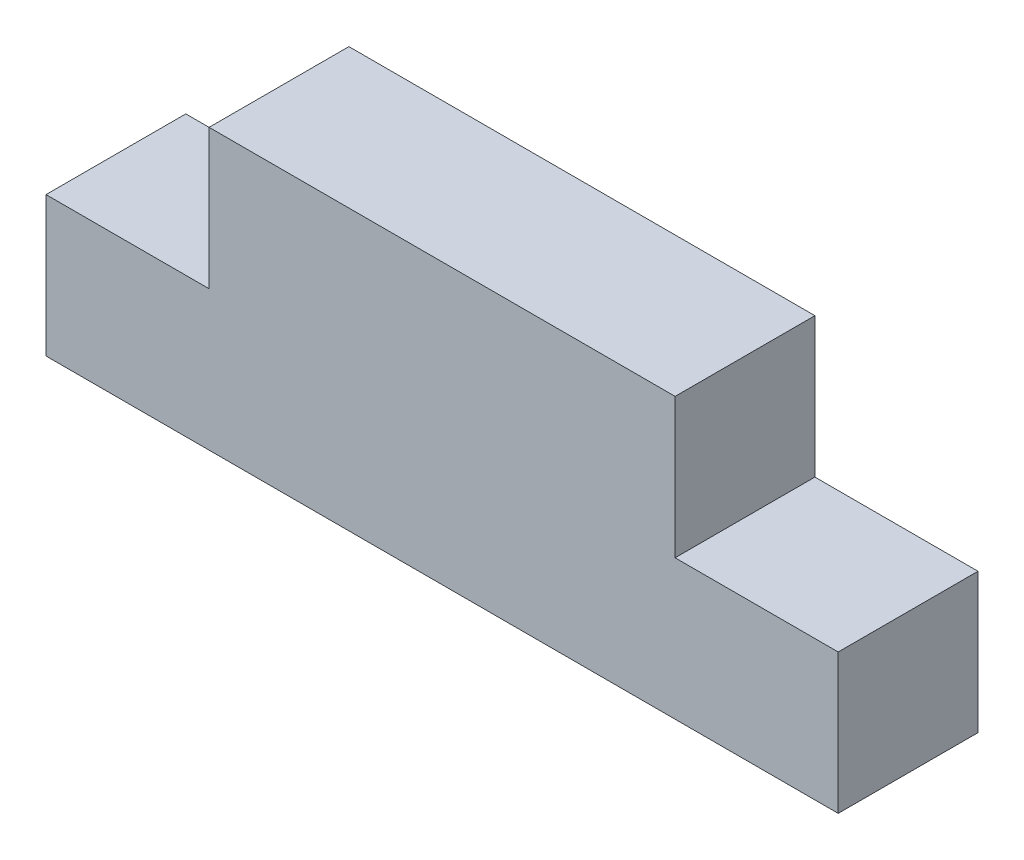
ISO-10303-21;
HEADER;
FILE_DESCRIPTION(('STEP AP214'),'2;1');
FILE_NAME('part.step','',(''),(''),'','','');
FILE_SCHEMA(('AUTOMOTIVE_DESIGN { 1 0 10303 214 1 1 1 1 }'));
ENDSEC;
DATA;
#1=APPLICATION_CONTEXT('core data for automotive mechanical design processes');
#2=APPLICATION_PROTOCOL_DEFINITION('international standard','automotive_design',2000,#1);
#3=PRODUCT_CONTEXT('',#1,'mechanical');
#4=PRODUCT('Part','Part','',(#3));
#5=PRODUCT_RELATED_PRODUCT_CATEGORY('part','',(#4));
#6=PRODUCT_DEFINITION_FORMATION('','',#4);
#7=PRODUCT_DEFINITION_CONTEXT('part definition',#1,'design');
#8=PRODUCT_DEFINITION('design','',#6,#7);
#9=PRODUCT_DEFINITION_SHAPE('','',#8);
#10=(LENGTH_UNIT() NAMED_UNIT(*) SI_UNIT(.MILLI.,.METRE.));
#11=(NAMED_UNIT(*) PLANE_ANGLE_UNIT() SI_UNIT($,.RADIAN.));
#12=(NAMED_UNIT(*) SI_UNIT($,.STERADIAN.) SOLID_ANGLE_UNIT());
#13=UNCERTAINTY_MEASURE_WITH_UNIT(LENGTH_MEASURE(1.E-05),#10,'distance_accuracy_value','');
#14=(GEOMETRIC_REPRESENTATION_CONTEXT(3) GLOBAL_UNCERTAINTY_ASSIGNED_CONTEXT((#13)) GLOBAL_UNIT_ASSIGNED_CONTEXT((#10,
#11,#12)) REPRESENTATION_CONTEXT('',''));
#15=CARTESIAN_POINT('',(0.,0.,0.));
#16=DIRECTION('',(0.,0.,1.));
#17=DIRECTION('',(1.,0.,0.));
#18=AXIS2_PLACEMENT_3D('',#15,#16,#17);
#19=CARTESIAN_POINT('',(0.,6.,6.));
#20=DIRECTION('',(0.,-1.,0.));
#21=DIRECTION('',(1.,0.,0.));
#22=AXIS2_PLACEMENT_3D('',#19,#20,#21);
#23=PLANE('',#22);
#24=DIRECTION('',(-1.,0.,0.));
#25=VECTOR('',#24,1.);
#26=CARTESIAN_POINT('',(0.,6.,0.));
#27=LINE('',#26,#25);
#28=CARTESIAN_POINT('',(34.,6.,0.));
#29=VERTEX_POINT('',#28);
#30=CARTESIAN_POINT('',(27.,6.,0.));
#31=VERTEX_POINT('',#30);
#32=EDGE_CURVE('E145',#29,#31,#27,.T.);
#33=ORIENTED_EDGE('',*,*,#32,.T.);
#34=DIRECTION('',(0.,0.,-1.));
#35=VECTOR('',#34,1.);
#36=CARTESIAN_POINT('',(27.,6.,6.));
#37=LINE('',#36,#35);
#38=CARTESIAN_POINT('',(27.,6.,6.));
#39=VERTEX_POINT('',#38);
#40=EDGE_CURVE('E11',#39,#31,#37,.T.);
#41=ORIENTED_EDGE('',*,*,#40,.F.);
#42=DIRECTION('',(-1.,0.,0.));
#43=VECTOR('',#42,1.);
#44=CARTESIAN_POINT('',(0.,6.,6.));
#45=LINE('',#44,#43);
#46=CARTESIAN_POINT('',(34.,6.,6.));
#47=VERTEX_POINT('',#46);
#48=EDGE_CURVE('E171',#47,#39,#45,.T.);
#49=ORIENTED_EDGE('',*,*,#48,.F.);
#50=DIRECTION('',(0.,0.,-1.));
#51=VECTOR('',#50,1.);
#52=CARTESIAN_POINT('',(34.,6.,6.));
#53=LINE('',#52,#51);
#54=EDGE_CURVE('E144',#47,#29,#53,.T.);
#55=ORIENTED_EDGE('',*,*,#54,.T.);
#56=EDGE_LOOP('',(#33,#41,#49,#55));
#57=FACE_BOUND('',#56,.T.);
#58=ADVANCED_FACE('F41',(#57),#23,.F.);
#59=CARTESIAN_POINT('',(27.,0.,6.));
#60=DIRECTION('',(-1.,0.,0.));
#61=DIRECTION('',(0.,0.,1.));
#62=AXIS2_PLACEMENT_3D('',#59,#60,#61);
#63=PLANE('',#62);
#64=DIRECTION('',(0.,1.,0.));
#65=VECTOR('',#64,1.);
#66=CARTESIAN_POINT('',(27.,0.,0.));
#67=LINE('',#66,#65);
#68=CARTESIAN_POINT('',(27.,12.,0.));
#69=VERTEX_POINT('',#68);
#70=EDGE_CURVE('E149',#31,#69,#67,.T.);
#71=ORIENTED_EDGE('',*,*,#70,.T.);
#72=DIRECTION('',(0.,0.,-1.));
#73=VECTOR('',#72,1.);
#74=CARTESIAN_POINT('',(27.,12.,6.));
#75=LINE('',#74,#73);
#76=CARTESIAN_POINT('',(27.,12.,6.));
#77=VERTEX_POINT('',#76);
#78=EDGE_CURVE('E50',#77,#69,#75,.T.);
#79=ORIENTED_EDGE('',*,*,#78,.F.);
#80=DIRECTION('',(0.,1.,0.));
#81=VECTOR('',#80,1.);
#82=CARTESIAN_POINT('',(27.,0.,6.));
#83=LINE('',#82,#81);
#84=EDGE_CURVE('E100',#39,#77,#83,.T.);
#85=ORIENTED_EDGE('',*,*,#84,.F.);
#86=ORIENTED_EDGE('',*,*,#40,.T.);
#87=EDGE_LOOP('',(#71,#79,#85,#86));
#88=FACE_BOUND('',#87,.T.);
#89=ADVANCED_FACE('F190',(#88),#63,.F.);
#90=CARTESIAN_POINT('',(0.,12.,6.));
#91=DIRECTION('',(0.,1.,0.));
#92=DIRECTION('',(0.,0.,1.));
#93=AXIS2_PLACEMENT_3D('',#90,#91,#92);
#94=PLANE('',#93);
#95=DIRECTION('',(1.,0.,0.));
#96=VECTOR('',#95,1.);
#97=CARTESIAN_POINT('',(0.,12.,0.));
#98=LINE('',#97,#96);
#99=CARTESIAN_POINT('',(7.,12.,0.));
#100=VERTEX_POINT('',#99);
#101=EDGE_CURVE('E153',#100,#69,#98,.T.);
#102=ORIENTED_EDGE('',*,*,#101,.F.);
#103=DIRECTION('',(0.,0.,-1.));
#104=VECTOR('',#103,1.);
#105=CARTESIAN_POINT('',(7.,12.,6.));
#106=LINE('',#105,#104);
#107=CARTESIAN_POINT('',(7.,12.,6.));
#108=VERTEX_POINT('',#107);
#109=EDGE_CURVE('E181',#108,#100,#106,.T.);
#110=ORIENTED_EDGE('',*,*,#109,.F.);
#111=DIRECTION('',(1.,0.,0.));
#112=VECTOR('',#111,1.);
#113=CARTESIAN_POINT('',(0.,12.,6.));
#114=LINE('',#113,#112);
#115=EDGE_CURVE('E189',#108,#77,#114,.T.);
#116=ORIENTED_EDGE('',*,*,#115,.T.);
#117=ORIENTED_EDGE('',*,*,#78,.T.);
#118=EDGE_LOOP('',(#102,#110,#116,#117));
#119=FACE_BOUND('',#118,.T.);
#120=ADVANCED_FACE('F187',(#119),#94,.T.);
#121=CARTESIAN_POINT('',(7.,0.,6.));
#122=DIRECTION('',(-1.,0.,0.));
#123=DIRECTION('',(0.,0.,1.));
#124=AXIS2_PLACEMENT_3D('',#121,#122,#123);
#125=PLANE('',#124);
#126=DIRECTION('',(0.,1.,0.));
#127=VECTOR('',#126,1.);
#128=CARTESIAN_POINT('',(7.,0.,0.));
#129=LINE('',#128,#127);
#130=CARTESIAN_POINT('',(7.,6.,0.));
#131=VERTEX_POINT('',#130);
#132=EDGE_CURVE('E157',#131,#100,#129,.T.);
#133=ORIENTED_EDGE('',*,*,#132,.F.);
#134=DIRECTION('',(0.,0.,-1.));
#135=VECTOR('',#134,1.);
#136=CARTESIAN_POINT('',(7.,6.,6.));
#137=LINE('',#136,#135);
#138=CARTESIAN_POINT('',(7.,6.,6.));
#139=VERTEX_POINT('',#138);
#140=EDGE_CURVE('E178',#139,#131,#137,.T.);
#141=ORIENTED_EDGE('',*,*,#140,.F.);
#142=DIRECTION('',(0.,1.,0.));
#143=VECTOR('',#142,1.);
#144=CARTESIAN_POINT('',(7.,0.,6.));
#145=LINE('',#144,#143);
#146=EDGE_CURVE('E138',#139,#108,#145,.T.);
#147=ORIENTED_EDGE('',*,*,#146,.T.);
#148=ORIENTED_EDGE('',*,*,#109,.T.);
#149=EDGE_LOOP('',(#133,#141,#147,#148));
#150=FACE_BOUND('',#149,.T.);
#151=ADVANCED_FACE('F198',(#150),#125,.T.);
#152=CARTESIAN_POINT('',(0.,6.,6.));
#153=DIRECTION('',(0.,1.,0.));
#154=DIRECTION('',(0.,0.,1.));
#155=AXIS2_PLACEMENT_3D('',#152,#153,#154);
#156=PLANE('',#155);
#157=DIRECTION('',(1.,0.,0.));
#158=VECTOR('',#157,1.);
#159=CARTESIAN_POINT('',(0.,6.,0.));
#160=LINE('',#159,#158);
#161=CARTESIAN_POINT('',(0.,6.,0.));
#162=VERTEX_POINT('',#161);
#163=EDGE_CURVE('E161',#162,#131,#160,.T.);
#164=ORIENTED_EDGE('',*,*,#163,.F.);
#165=DIRECTION('',(0.,0.,-1.));
#166=VECTOR('',#165,1.);
#167=CARTESIAN_POINT('',(0.,6.,6.));
#168=LINE('',#167,#166);
#169=CARTESIAN_POINT('',(0.,6.,6.));
#170=VERTEX_POINT('',#169);
#171=EDGE_CURVE('E123',#170,#162,#168,.T.);
#172=ORIENTED_EDGE('',*,*,#171,.F.);
#173=DIRECTION('',(1.,0.,0.));
#174=VECTOR('',#173,1.);
#175=CARTESIAN_POINT('',(0.,6.,6.));
#176=LINE('',#175,#174);
#177=EDGE_CURVE('E134',#170,#139,#176,.T.);
#178=ORIENTED_EDGE('',*,*,#177,.T.);
#179=ORIENTED_EDGE('',*,*,#140,.T.);
#180=EDGE_LOOP('',(#164,#172,#178,#179));
#181=FACE_BOUND('',#180,.T.);
#182=ADVANCED_FACE('F230',(#181),#156,.T.);
#183=CARTESIAN_POINT('',(0.,0.,6.));
#184=DIRECTION('',(-1.,0.,0.));
#185=DIRECTION('',(0.,0.,1.));
#186=AXIS2_PLACEMENT_3D('',#183,#184,#185);
#187=PLANE('',#186);
#188=DIRECTION('',(0.,1.,0.));
#189=VECTOR('',#188,1.);
#190=CARTESIAN_POINT('',(0.,0.,0.));
#191=LINE('',#190,#189);
#192=CARTESIAN_POINT('',(0.,0.,0.));
#193=VERTEX_POINT('',#192);
#194=EDGE_CURVE('E121',#193,#162,#191,.T.);
#195=ORIENTED_EDGE('',*,*,#194,.F.);
#196=DIRECTION('',(0.,0.,-1.));
#197=VECTOR('',#196,1.);
#198=CARTESIAN_POINT('',(0.,0.,6.));
#199=LINE('',#198,#197);
#200=CARTESIAN_POINT('',(0.,0.,6.));
#201=VERTEX_POINT('',#200);
#202=EDGE_CURVE('E115',#201,#193,#199,.T.);
#203=ORIENTED_EDGE('',*,*,#202,.F.);
#204=DIRECTION('',(0.,1.,0.));
#205=VECTOR('',#204,1.);
#206=CARTESIAN_POINT('',(0.,0.,6.));
#207=LINE('',#206,#205);
#208=EDGE_CURVE('E119',#201,#170,#207,.T.);
#209=ORIENTED_EDGE('',*,*,#208,.T.);
#210=ORIENTED_EDGE('',*,*,#171,.T.);
#211=EDGE_LOOP('',(#195,#203,#209,#210));
#212=FACE_BOUND('',#211,.T.);
#213=ADVANCED_FACE('F117',(#212),#187,.T.);
#214=CARTESIAN_POINT('',(0.,0.,6.));
#215=DIRECTION('',(0.,1.,0.));
#216=DIRECTION('',(0.,0.,1.));
#217=AXIS2_PLACEMENT_3D('',#214,#215,#216);
#218=PLANE('',#217);
#219=DIRECTION('',(1.,0.,0.));
#220=VECTOR('',#219,1.);
#221=CARTESIAN_POINT('',(0.,0.,0.));
#222=LINE('',#221,#220);
#223=CARTESIAN_POINT('',(34.,0.,0.));
#224=VERTEX_POINT('',#223);
#225=EDGE_CURVE('E86',#193,#224,#222,.T.);
#226=ORIENTED_EDGE('',*,*,#225,.T.);
#227=DIRECTION('',(0.,0.,-1.));
#228=VECTOR('',#227,1.);
#229=CARTESIAN_POINT('',(34.,0.,6.));
#230=LINE('',#229,#228);
#231=CARTESIAN_POINT('',(34.,0.,6.));
#232=VERTEX_POINT('',#231);
#233=EDGE_CURVE('E124',#232,#224,#230,.T.);
#234=ORIENTED_EDGE('',*,*,#233,.F.);
#235=DIRECTION('',(1.,0.,0.));
#236=VECTOR('',#235,1.);
#237=CARTESIAN_POINT('',(0.,0.,6.));
#238=LINE('',#237,#236);
#239=EDGE_CURVE('E126',#201,#232,#238,.T.);
#240=ORIENTED_EDGE('',*,*,#239,.F.);
#241=ORIENTED_EDGE('',*,*,#202,.T.);
#242=EDGE_LOOP('',(#226,#234,#240,#241));
#243=FACE_BOUND('',#242,.T.);
#244=ADVANCED_FACE('F127',(#243),#218,.F.);
#245=CARTESIAN_POINT('',(34.,0.,6.));
#246=DIRECTION('',(-1.,0.,0.));
#247=DIRECTION('',(0.,0.,1.));
#248=AXIS2_PLACEMENT_3D('',#245,#246,#247);
#249=PLANE('',#248);
#250=DIRECTION('',(0.,1.,0.));
#251=VECTOR('',#250,1.);
#252=CARTESIAN_POINT('',(34.,0.,0.));
#253=LINE('',#252,#251);
#254=EDGE_CURVE('E92',#224,#29,#253,.T.);
#255=ORIENTED_EDGE('',*,*,#254,.T.);
#256=ORIENTED_EDGE('',*,*,#54,.F.);
#257=DIRECTION('',(0.,1.,0.));
#258=VECTOR('',#257,1.);
#259=CARTESIAN_POINT('',(34.,0.,6.));
#260=LINE('',#259,#258);
#261=EDGE_CURVE('E58',#232,#47,#260,.T.);
#262=ORIENTED_EDGE('',*,*,#261,.F.);
#263=ORIENTED_EDGE('',*,*,#233,.T.);
#264=EDGE_LOOP('',(#255,#256,#262,#263));
#265=FACE_BOUND('',#264,.T.);
#266=ADVANCED_FACE('F209',(#265),#249,.F.);
#267=CARTESIAN_POINT('',(0.,0.,6.));
#268=DIRECTION('',(0.,0.,1.));
#269=DIRECTION('',(1.,0.,0.));
#270=AXIS2_PLACEMENT_3D('',#267,#268,#269);
#271=PLANE('',#270);
#272=ORIENTED_EDGE('',*,*,#48,.T.);
#273=ORIENTED_EDGE('',*,*,#84,.T.);
#274=ORIENTED_EDGE('',*,*,#115,.F.);
#275=ORIENTED_EDGE('',*,*,#146,.F.);
#276=ORIENTED_EDGE('',*,*,#177,.F.);
#277=ORIENTED_EDGE('',*,*,#208,.F.);
#278=ORIENTED_EDGE('',*,*,#239,.T.);
#279=ORIENTED_EDGE('',*,*,#261,.T.);
#280=EDGE_LOOP('',(#272,#273,#274,#275,#276,#277,#278,#279));
#281=FACE_BOUND('',#280,.T.);
#282=ADVANCED_FACE('F131',(#281),#271,.T.);
#283=CARTESIAN_POINT('',(0.,0.,0.));
#284=DIRECTION('',(0.,0.,1.));
#285=DIRECTION('',(1.,0.,0.));
#286=AXIS2_PLACEMENT_3D('',#283,#284,#285);
#287=PLANE('',#286);
#288=ORIENTED_EDGE('',*,*,#32,.F.);
#289=ORIENTED_EDGE('',*,*,#254,.F.);
#290=ORIENTED_EDGE('',*,*,#225,.F.);
#291=ORIENTED_EDGE('',*,*,#194,.T.);
#292=ORIENTED_EDGE('',*,*,#163,.T.);
#293=ORIENTED_EDGE('',*,*,#132,.T.);
#294=ORIENTED_EDGE('',*,*,#101,.T.);
#295=ORIENTED_EDGE('',*,*,#70,.F.);
#296=EDGE_LOOP('',(#288,#289,#290,#291,#292,#293,#294,#295));
#297=FACE_BOUND('',#296,.T.);
#298=ADVANCED_FACE('F194',(#297),#287,.F.);
#299=CLOSED_SHELL('',(#58,#89,#120,#151,#182,#213,#244,#266,#282,#298));
#300=MANIFOLD_SOLID_BREP('B2',#299);
#301=ADVANCED_BREP_SHAPE_REPRESENTATION('',(#18,#300),#14);
#302=SHAPE_DEFINITION_REPRESENTATION(#9,#301);
ENDSEC;
END-ISO-10303-21;
